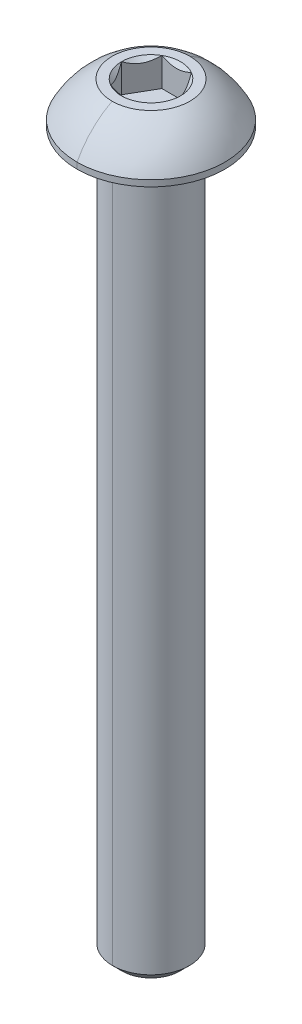
ISO-10303-21;
HEADER;
FILE_DESCRIPTION(('STEP AP214'),'2;1');
FILE_NAME('part.step','',(''),(''),'','','');
FILE_SCHEMA(('AUTOMOTIVE_DESIGN { 1 0 10303 214 1 1 1 1 }'));
ENDSEC;
DATA;
#1=APPLICATION_CONTEXT('core data for automotive mechanical design processes');
#2=APPLICATION_PROTOCOL_DEFINITION('international standard','automotive_design',2000,#1);
#3=PRODUCT_CONTEXT('',#1,'mechanical');
#4=PRODUCT('Part','Part','',(#3));
#5=PRODUCT_RELATED_PRODUCT_CATEGORY('part','',(#4));
#6=PRODUCT_DEFINITION_FORMATION('','',#4);
#7=PRODUCT_DEFINITION_CONTEXT('part definition',#1,'design');
#8=PRODUCT_DEFINITION('design','',#6,#7);
#9=PRODUCT_DEFINITION_SHAPE('','',#8);
#10=(LENGTH_UNIT() NAMED_UNIT(*) SI_UNIT(.MILLI.,.METRE.));
#11=(NAMED_UNIT(*) PLANE_ANGLE_UNIT() SI_UNIT($,.RADIAN.));
#12=(NAMED_UNIT(*) SI_UNIT($,.STERADIAN.) SOLID_ANGLE_UNIT());
#13=UNCERTAINTY_MEASURE_WITH_UNIT(LENGTH_MEASURE(1.E-05),#10,'distance_accuracy_value','');
#14=(GEOMETRIC_REPRESENTATION_CONTEXT(3) GLOBAL_UNCERTAINTY_ASSIGNED_CONTEXT((#13)) GLOBAL_UNIT_ASSIGNED_CONTEXT((#10,
#11,#12)) REPRESENTATION_CONTEXT('',''));
#15=CARTESIAN_POINT('',(0.,0.,0.));
#16=DIRECTION('',(0.,0.,1.));
#17=DIRECTION('',(1.,0.,0.));
#18=AXIS2_PLACEMENT_3D('',#15,#16,#17);
#19=CARTESIAN_POINT('',(0.,-0.152399999999997,0.));
#20=DIRECTION('',(0.,1.,0.));
#21=DIRECTION('',(0.,0.,1.));
#22=AXIS2_PLACEMENT_3D('',#19,#20,#21);
#23=TOROIDAL_SURFACE('',#22,2.5273,0.1524);
#24=CARTESIAN_POINT('',(0.,-0.152399999999997,-2.5273));
#25=DIRECTION('',(1.,0.,0.));
#26=DIRECTION('',(0.,0.,-1.));
#27=AXIS2_PLACEMENT_3D('',#24,#25,#26);
#28=CIRCLE('',#27,0.1524);
#29=CARTESIAN_POINT('',(0.,0.,-2.5273));
#30=VERTEX_POINT('',#29);
#31=CARTESIAN_POINT('',(0.,-0.152399999999997,-2.3749));
#32=VERTEX_POINT('',#31);
#33=EDGE_CURVE('E246',#30,#32,#28,.T.);
#34=ORIENTED_EDGE('',*,*,#33,.F.);
#35=CARTESIAN_POINT('',(0.,0.,0.));
#36=DIRECTION('',(0.,1.,0.));
#37=DIRECTION('',(0.,0.,1.));
#38=AXIS2_PLACEMENT_3D('',#35,#36,#37);
#39=CIRCLE('',#38,2.5273);
#40=CARTESIAN_POINT('',(0.,0.,2.5273));
#41=VERTEX_POINT('',#40);
#42=EDGE_CURVE('E254',#41,#30,#39,.T.);
#43=ORIENTED_EDGE('',*,*,#42,.F.);
#44=CARTESIAN_POINT('',(0.,-0.152399999999997,2.5273));
#45=DIRECTION('',(-1.,0.,0.));
#46=DIRECTION('',(0.,0.,1.));
#47=AXIS2_PLACEMENT_3D('',#44,#45,#46);
#48=CIRCLE('',#47,0.1524);
#49=CARTESIAN_POINT('',(0.,-0.152399999999997,2.3749));
#50=VERTEX_POINT('',#49);
#51=EDGE_CURVE('E253',#41,#50,#48,.T.);
#52=ORIENTED_EDGE('',*,*,#51,.T.);
#53=CARTESIAN_POINT('',(0.,-0.152399999999997,0.));
#54=DIRECTION('',(0.,-1.,0.));
#55=DIRECTION('',(0.,0.,1.));
#56=AXIS2_PLACEMENT_3D('',#53,#54,#55);
#57=CIRCLE('',#56,2.3749);
#58=EDGE_CURVE('E310',#32,#50,#57,.T.);
#59=ORIENTED_EDGE('',*,*,#58,.F.);
#60=EDGE_LOOP('',(#34,#43,#52,#59));
#61=FACE_BOUND('',#60,.T.);
#62=ADVANCED_FACE('F16',(#61),#23,.F.);
#63=CARTESIAN_POINT('',(0.,2.5654,0.));
#64=DIRECTION('',(0.,1.,0.));
#65=DIRECTION('',(0.,0.,1.));
#66=AXIS2_PLACEMENT_3D('',#63,#64,#65);
#67=CONICAL_SURFACE('',#66,1.83308710467706,0.78539816339745);
#68=DIRECTION('',(0.,0.707106781186546,-0.707106781186549));
#69=VECTOR('',#68,1.);
#70=CARTESIAN_POINT('',(0.,2.5654,-1.83308710467706));
#71=LINE('',#70,#69);
#72=CARTESIAN_POINT('',(0.,0.732312895322944,0.));
#73=VERTEX_POINT('',#72);
#74=CARTESIAN_POINT('',(0.,0.7874,-0.0550871046770556));
#75=VERTEX_POINT('',#74);
#76=EDGE_CURVE('E240',#73,#75,#71,.T.);
#77=ORIENTED_EDGE('',*,*,#76,.F.);
#78=DIRECTION('',(0.,0.707106781186546,0.707106781186549));
#79=VECTOR('',#78,1.);
#80=CARTESIAN_POINT('',(0.,2.5654,1.83308710467706));
#81=LINE('',#80,#79);
#82=CARTESIAN_POINT('',(0.,0.7874,0.0550871046770556));
#83=VERTEX_POINT('',#82);
#84=EDGE_CURVE('E245',#73,#83,#81,.T.);
#85=ORIENTED_EDGE('',*,*,#84,.T.);
#86=CARTESIAN_POINT('',(0.,0.7874,0.));
#87=DIRECTION('',(0.,1.,0.));
#88=DIRECTION('',(0.,0.,1.));
#89=AXIS2_PLACEMENT_3D('',#86,#87,#88);
#90=CIRCLE('',#89,0.0550871046770558);
#91=EDGE_CURVE('E214',#83,#75,#90,.T.);
#92=ORIENTED_EDGE('',*,*,#91,.T.);
#93=EDGE_LOOP('',(#77,#85,#92));
#94=FACE_BOUND('',#93,.T.);
#95=ADVANCED_FACE('F334',(#94),#67,.F.);
#96=CARTESIAN_POINT('',(1.83308710467706,0.7874,0.));
#97=DIRECTION('',(0.866025403784439,0.,-0.5));
#98=DIRECTION('',(0.,-1.,0.));
#99=AXIS2_PLACEMENT_3D('',#96,#97,#98);
#100=PLANE('',#99);
#101=DIRECTION('',(0.,1.,0.));
#102=VECTOR('',#101,1.);
#103=CARTESIAN_POINT('',(1.83308710467706,0.7874,0.));
#104=LINE('',#103,#102);
#105=CARTESIAN_POINT('',(1.83308710467706,0.7874,0.));
#106=VERTEX_POINT('',#105);
#107=CARTESIAN_POINT('',(1.83308710467706,2.5654,0.));
#108=VERTEX_POINT('',#107);
#109=EDGE_CURVE('E11',#106,#108,#104,.T.);
#110=ORIENTED_EDGE('',*,*,#109,.T.);
#111=CARTESIAN_POINT('',(1.83308710467706,2.5654,0.));
#112=CARTESIAN_POINT('',(1.58854939316106,2.32086228848399,-0.423551740712339));
#113=CARTESIAN_POINT('',(1.37650342717985,2.31981648546325,-0.790826127331817));
#114=CARTESIAN_POINT('',(1.16317917435944,2.31876437797812,-1.16031457170343));
#115=CARTESIAN_POINT('',(0.91654355233853,2.5654,-1.5875));
#116=B_SPLINE_CURVE_WITH_KNOTS('',2,(#111,#112,#113,#114,#115),.UNSPECIFIED.,.F.,.F.,(3,2,3),
(0.,0.5,1.),.UNSPECIFIED.);
#117=CARTESIAN_POINT('',(0.916543552338531,2.5654,-1.5875));
#118=VERTEX_POINT('',#117);
#119=EDGE_CURVE('E154',#108,#118,#116,.T.);
#120=ORIENTED_EDGE('',*,*,#119,.T.);
#121=DIRECTION('',(0.,1.,0.));
#122=VECTOR('',#121,1.);
#123=CARTESIAN_POINT('',(0.916543552338531,0.7874,-1.5875));
#124=LINE('',#123,#122);
#125=CARTESIAN_POINT('',(0.916543552338531,0.7874,-1.5875));
#126=VERTEX_POINT('',#125);
#127=EDGE_CURVE('E210',#126,#118,#124,.T.);
#128=ORIENTED_EDGE('',*,*,#127,.F.);
#129=DIRECTION('',(-0.5,0.,-0.866025403784439));
#130=VECTOR('',#129,1.);
#131=CARTESIAN_POINT('',(1.83308710467706,0.7874,0.));
#132=LINE('',#131,#130);
#133=EDGE_CURVE('E158',#106,#126,#132,.T.);
#134=ORIENTED_EDGE('',*,*,#133,.F.);
#135=EDGE_LOOP('',(#110,#120,#128,#134));
#136=FACE_BOUND('',#135,.T.);
#137=ADVANCED_FACE('F153',(#136),#100,.F.);
#138=CARTESIAN_POINT('',(0.916543552338531,0.7874,1.5875));
#139=DIRECTION('',(0.866025403784439,0.,0.5));
#140=DIRECTION('',(0.,-1.,0.));
#141=AXIS2_PLACEMENT_3D('',#138,#139,#140);
#142=PLANE('',#141);
#143=DIRECTION('',(0.,1.,0.));
#144=VECTOR('',#143,1.);
#145=CARTESIAN_POINT('',(0.916543552338531,0.7874,1.5875));
#146=LINE('',#145,#144);
#147=CARTESIAN_POINT('',(0.916543552338531,0.7874,1.5875));
#148=VERTEX_POINT('',#147);
#149=CARTESIAN_POINT('',(0.916543552338531,2.5654,1.5875));
#150=VERTEX_POINT('',#149);
#151=EDGE_CURVE('E29',#148,#150,#146,.T.);
#152=ORIENTED_EDGE('',*,*,#151,.T.);
#153=CARTESIAN_POINT('',(0.916543552338531,2.5654,1.5875));
#154=CARTESIAN_POINT('',(1.16108126385472,2.32086228848382,1.16394825928734));
#155=CARTESIAN_POINT('',(1.37312722983574,2.31981648546325,0.796673872668184));
#156=CARTESIAN_POINT('',(1.58645148265633,2.3187643779783,0.427185428296259));
#157=CARTESIAN_POINT('',(1.83308710467706,2.5654,0.));
#158=B_SPLINE_CURVE_WITH_KNOTS('',2,(#153,#154,#155,#156,#157),.UNSPECIFIED.,.F.,.F.,(3,2,3),
(0.,0.5,1.),.UNSPECIFIED.);
#159=EDGE_CURVE('E170',#150,#108,#158,.T.);
#160=ORIENTED_EDGE('',*,*,#159,.T.);
#161=ORIENTED_EDGE('',*,*,#109,.F.);
#162=DIRECTION('',(0.5,0.,-0.866025403784439));
#163=VECTOR('',#162,1.);
#164=CARTESIAN_POINT('',(0.916543552338531,0.7874,1.5875));
#165=LINE('',#164,#163);
#166=EDGE_CURVE('E226',#148,#106,#165,.T.);
#167=ORIENTED_EDGE('',*,*,#166,.F.);
#168=EDGE_LOOP('',(#152,#160,#161,#167));
#169=FACE_BOUND('',#168,.T.);
#170=ADVANCED_FACE('F176',(#169),#142,.F.);
#171=CARTESIAN_POINT('',(-0.91654355233853,0.7874,1.5875));
#172=DIRECTION('',(0.,0.,1.));
#173=DIRECTION('',(1.,0.,0.));
#174=AXIS2_PLACEMENT_3D('',#171,#172,#173);
#175=PLANE('',#174);
#176=DIRECTION('',(0.,1.,0.));
#177=VECTOR('',#176,1.);
#178=CARTESIAN_POINT('',(-0.91654355233853,0.7874,1.5875));
#179=LINE('',#178,#177);
#180=CARTESIAN_POINT('',(-0.91654355233853,0.7874,1.5875));
#181=VERTEX_POINT('',#180);
#182=CARTESIAN_POINT('',(-0.91654355233853,2.5654,1.5875));
#183=VERTEX_POINT('',#182);
#184=EDGE_CURVE('E760',#181,#183,#179,.T.);
#185=ORIENTED_EDGE('',*,*,#184,.T.);
#186=CARTESIAN_POINT('',(-0.916543552338531,2.5654,1.5875));
#187=CARTESIAN_POINT('',(-0.684381010738564,2.44931872920002,1.5875));
#188=CARTESIAN_POINT('',(-0.4718738638875,2.38845938444161,1.5875));
#189=CARTESIAN_POINT('',(-0.232175759974894,2.31981289532294,1.5875));
#190=CARTESIAN_POINT('',(0.,2.31981289532294,1.5875));
#191=B_SPLINE_CURVE_WITH_KNOTS('',2,(#186,#187,#188,#189,#190),.UNSPECIFIED.,.F.,.F.,(3,2,3),
(0.,0.5,1.),.UNSPECIFIED.);
#192=CARTESIAN_POINT('',(0.,2.31981289532294,1.5875));
#193=VERTEX_POINT('',#192);
#194=EDGE_CURVE('E181',#183,#193,#191,.T.);
#195=ORIENTED_EDGE('',*,*,#194,.T.);
#196=CARTESIAN_POINT('',(0.,2.31981289532294,1.5875));
#197=CARTESIAN_POINT('',(0.229732695645398,2.31981289532294,1.5875));
#198=CARTESIAN_POINT('',(0.471961624215038,2.3884843914945,1.5875));
#199=CARTESIAN_POINT('',(0.68154594324368,2.44790119545257,1.5875));
#200=CARTESIAN_POINT('',(0.91654355233853,2.5654,1.5875));
#201=B_SPLINE_CURVE_WITH_KNOTS('',2,(#196,#197,#198,#199,#200),.UNSPECIFIED.,.F.,.F.,(3,2,3),
(0.,0.5,1.),.UNSPECIFIED.);
#202=EDGE_CURVE('E392',#193,#150,#201,.T.);
#203=ORIENTED_EDGE('',*,*,#202,.T.);
#204=ORIENTED_EDGE('',*,*,#151,.F.);
#205=DIRECTION('',(1.,0.,0.));
#206=VECTOR('',#205,1.);
#207=CARTESIAN_POINT('',(-0.91654355233853,0.7874,1.5875));
#208=LINE('',#207,#206);
#209=EDGE_CURVE('E234',#181,#148,#208,.T.);
#210=ORIENTED_EDGE('',*,*,#209,.F.);
#211=EDGE_LOOP('',(#185,#195,#203,#204,#210));
#212=FACE_BOUND('',#211,.T.);
#213=ADVANCED_FACE('F339',(#212),#175,.F.);
#214=CARTESIAN_POINT('',(-1.83308710467706,0.7874,0.));
#215=DIRECTION('',(-0.866025403784439,0.,0.5));
#216=DIRECTION('',(0.,1.,0.));
#217=AXIS2_PLACEMENT_3D('',#214,#215,#216);
#218=PLANE('',#217);
#219=DIRECTION('',(0.,1.,0.));
#220=VECTOR('',#219,1.);
#221=CARTESIAN_POINT('',(-1.83308710467706,0.7874,0.));
#222=LINE('',#221,#220);
#223=CARTESIAN_POINT('',(-1.83308710467706,0.7874,0.));
#224=VERTEX_POINT('',#223);
#225=CARTESIAN_POINT('',(-1.83308710467706,2.5654,0.));
#226=VERTEX_POINT('',#225);
#227=EDGE_CURVE('E224',#224,#226,#222,.T.);
#228=ORIENTED_EDGE('',*,*,#227,.T.);
#229=CARTESIAN_POINT('',(-1.83308710467706,2.5654,0.));
#230=CARTESIAN_POINT('',(-1.58854939316106,2.32086228848399,0.423551740712331));
#231=CARTESIAN_POINT('',(-1.37650342717985,2.31981648546325,0.790826127331817));
#232=CARTESIAN_POINT('',(-1.16317917435944,2.31876437797812,1.16031457170343));
#233=CARTESIAN_POINT('',(-0.91654355233853,2.5654,1.5875));
#234=B_SPLINE_CURVE_WITH_KNOTS('',2,(#229,#230,#231,#232,#233),.UNSPECIFIED.,.F.,.F.,(3,2,3),
(0.,0.5,1.),.UNSPECIFIED.);
#235=EDGE_CURVE('E856',#226,#183,#234,.T.);
#236=ORIENTED_EDGE('',*,*,#235,.T.);
#237=ORIENTED_EDGE('',*,*,#184,.F.);
#238=DIRECTION('',(0.5,0.,0.866025403784438));
#239=VECTOR('',#238,1.);
#240=CARTESIAN_POINT('',(-1.83308710467706,0.7874,0.));
#241=LINE('',#240,#239);
#242=EDGE_CURVE('E259',#224,#181,#241,.T.);
#243=ORIENTED_EDGE('',*,*,#242,.F.);
#244=EDGE_LOOP('',(#228,#236,#237,#243));
#245=FACE_BOUND('',#244,.T.);
#246=ADVANCED_FACE('F370',(#245),#218,.F.);
#247=CARTESIAN_POINT('',(-0.916543552338531,0.7874,-1.5875));
#248=DIRECTION('',(-0.866025403784439,0.,-0.5));
#249=DIRECTION('',(-0.5,0.,0.866025403784439));
#250=AXIS2_PLACEMENT_3D('',#247,#248,#249);
#251=PLANE('',#250);
#252=DIRECTION('',(0.,1.,0.));
#253=VECTOR('',#252,1.);
#254=CARTESIAN_POINT('',(-0.916543552338531,0.7874,-1.5875));
#255=LINE('',#254,#253);
#256=CARTESIAN_POINT('',(-0.916543552338531,0.7874,-1.5875));
#257=VERTEX_POINT('',#256);
#258=CARTESIAN_POINT('',(-0.916543552338531,2.5654,-1.5875));
#259=VERTEX_POINT('',#258);
#260=EDGE_CURVE('E213',#257,#259,#255,.T.);
#261=ORIENTED_EDGE('',*,*,#260,.T.);
#262=CARTESIAN_POINT('',(-0.916543552338531,2.5654,-1.5875));
#263=CARTESIAN_POINT('',(-1.16108126385453,2.320862288484,-1.16394825928767));
#264=CARTESIAN_POINT('',(-1.37312722983574,2.31981648546325,-0.796673872668183));
#265=CARTESIAN_POINT('',(-1.58645148265615,2.31876437797813,-0.427185428296571));
#266=CARTESIAN_POINT('',(-1.83308710467706,2.5654,0.));
#267=B_SPLINE_CURVE_WITH_KNOTS('',2,(#262,#263,#264,#265,#266),.UNSPECIFIED.,.F.,.F.,(3,2,3),
(0.,0.5,1.),.UNSPECIFIED.);
#268=EDGE_CURVE('E861',#259,#226,#267,.T.);
#269=ORIENTED_EDGE('',*,*,#268,.T.);
#270=ORIENTED_EDGE('',*,*,#227,.F.);
#271=DIRECTION('',(-0.5,0.,0.866025403784439));
#272=VECTOR('',#271,1.);
#273=CARTESIAN_POINT('',(-0.916543552338531,0.7874,-1.5875));
#274=LINE('',#273,#272);
#275=EDGE_CURVE('E263',#257,#224,#274,.T.);
#276=ORIENTED_EDGE('',*,*,#275,.F.);
#277=EDGE_LOOP('',(#261,#269,#270,#276));
#278=FACE_BOUND('',#277,.T.);
#279=ADVANCED_FACE('F588',(#278),#251,.F.);
#280=CARTESIAN_POINT('',(0.916543552338531,0.7874,-1.5875));
#281=DIRECTION('',(0.,0.,-1.));
#282=DIRECTION('',(-1.,0.,0.));
#283=AXIS2_PLACEMENT_3D('',#280,#281,#282);
#284=PLANE('',#283);
#285=ORIENTED_EDGE('',*,*,#127,.T.);
#286=CARTESIAN_POINT('',(0.916543552338531,2.5654,-1.5875));
#287=CARTESIAN_POINT('',(0.68330023814449,2.44877834290298,-1.5875));
#288=CARTESIAN_POINT('',(0.472022049766507,2.38850161206546,-1.5875));
#289=CARTESIAN_POINT('',(0.231606862063275,2.31991222444484,-1.5875));
#290=CARTESIAN_POINT('',(0.000126990617285933,2.31981290040219,-1.5875));
#291=CARTESIAN_POINT('',(-0.230319895797069,2.3197140195957,-1.5875));
#292=CARTESIAN_POINT('',(-0.471813597713689,2.38844221424328,-1.5875));
#293=CARTESIAN_POINT('',(-0.682613944360854,2.44843519601116,-1.5875));
#294=CARTESIAN_POINT('',(-0.916543552338529,2.5654,-1.5875));
#295=B_SPLINE_CURVE_WITH_KNOTS('',2,(#286,#287,#288,#289,#290,#291,#292,#293,#294),
.UNSPECIFIED.,.F.,.F.,(3,2,2,2,3),(0.,0.25,0.5,0.75,1.),.UNSPECIFIED.);
#296=EDGE_CURVE('E875',#118,#259,#295,.T.);
#297=ORIENTED_EDGE('',*,*,#296,.T.);
#298=ORIENTED_EDGE('',*,*,#260,.F.);
#299=DIRECTION('',(-1.,0.,0.));
#300=VECTOR('',#299,1.);
#301=CARTESIAN_POINT('',(0.916543552338531,0.7874,-1.5875));
#302=LINE('',#301,#300);
#303=EDGE_CURVE('E281',#126,#257,#302,.T.);
#304=ORIENTED_EDGE('',*,*,#303,.F.);
#305=EDGE_LOOP('',(#285,#297,#298,#304));
#306=FACE_BOUND('',#305,.T.);
#307=ADVANCED_FACE('F593',(#306),#284,.F.);
#308=CARTESIAN_POINT('',(0.,0.7874,0.));
#309=DIRECTION('',(0.,1.,0.));
#310=DIRECTION('',(1.,0.,0.));
#311=AXIS2_PLACEMENT_3D('',#308,#309,#310);
#312=PLANE('',#311);
#313=ORIENTED_EDGE('',*,*,#91,.F.);
#314=CARTESIAN_POINT('',(0.,0.7874,0.));
#315=DIRECTION('',(0.,1.,0.));
#316=DIRECTION('',(0.,0.,1.));
#317=AXIS2_PLACEMENT_3D('',#314,#315,#316);
#318=CIRCLE('',#317,0.0550871046770558);
#319=EDGE_CURVE('E244',#75,#83,#318,.T.);
#320=ORIENTED_EDGE('',*,*,#319,.F.);
#321=EDGE_LOOP('',(#313,#320));
#322=FACE_BOUND('',#321,.T.);
#323=ORIENTED_EDGE('',*,*,#133,.T.);
#324=ORIENTED_EDGE('',*,*,#303,.T.);
#325=ORIENTED_EDGE('',*,*,#275,.T.);
#326=ORIENTED_EDGE('',*,*,#242,.T.);
#327=ORIENTED_EDGE('',*,*,#209,.T.);
#328=ORIENTED_EDGE('',*,*,#166,.T.);
#329=EDGE_LOOP('',(#323,#324,#325,#326,#327,#328));
#330=FACE_BOUND('',#329,.T.);
#331=ADVANCED_FACE('F371',(#322,#330),#312,.T.);
#332=CARTESIAN_POINT('',(0.,2.5654,0.));
#333=DIRECTION('',(0.,1.,0.));
#334=DIRECTION('',(0.,0.,1.));
#335=AXIS2_PLACEMENT_3D('',#332,#333,#334);
#336=CONICAL_SURFACE('',#335,1.83308710467706,0.78539816339745);
#337=CARTESIAN_POINT('',(0.,2.5654,0.));
#338=DIRECTION('',(0.,1.,0.));
#339=DIRECTION('',(0.,0.,1.));
#340=AXIS2_PLACEMENT_3D('',#337,#338,#339);
#341=CIRCLE('',#340,1.83308710467706);
#342=EDGE_CURVE('E167',#108,#118,#341,.T.);
#343=ORIENTED_EDGE('',*,*,#342,.T.);
#344=ORIENTED_EDGE('',*,*,#119,.F.);
#345=EDGE_LOOP('',(#343,#344));
#346=FACE_BOUND('',#345,.T.);
#347=ADVANCED_FACE('F165',(#346),#336,.F.);
#348=CARTESIAN_POINT('',(0.,2.5654,0.));
#349=DIRECTION('',(0.,1.,0.));
#350=DIRECTION('',(0.,0.,1.));
#351=AXIS2_PLACEMENT_3D('',#348,#349,#350);
#352=CONICAL_SURFACE('',#351,1.83308710467706,0.78539816339745);
#353=CARTESIAN_POINT('',(0.,2.5654,0.));
#354=DIRECTION('',(0.,1.,0.));
#355=DIRECTION('',(0.,0.,1.));
#356=AXIS2_PLACEMENT_3D('',#353,#354,#355);
#357=CIRCLE('',#356,1.83308710467706);
#358=EDGE_CURVE('E184',#150,#108,#357,.T.);
#359=ORIENTED_EDGE('',*,*,#358,.T.);
#360=ORIENTED_EDGE('',*,*,#159,.F.);
#361=EDGE_LOOP('',(#359,#360));
#362=FACE_BOUND('',#361,.T.);
#363=ADVANCED_FACE('F185',(#362),#352,.F.);
#364=CARTESIAN_POINT('',(0.,2.5654,0.));
#365=DIRECTION('',(0.,1.,0.));
#366=DIRECTION('',(0.,0.,1.));
#367=AXIS2_PLACEMENT_3D('',#364,#365,#366);
#368=CONICAL_SURFACE('',#367,1.83308710467706,0.78539816339745);
#369=DIRECTION('',(0.,0.707106781186546,0.707106781186549));
#370=VECTOR('',#369,1.);
#371=CARTESIAN_POINT('',(0.,2.5654,1.83308710467706));
#372=LINE('',#371,#370);
#373=CARTESIAN_POINT('',(0.,2.5654,1.83308710467706));
#374=VERTEX_POINT('',#373);
#375=EDGE_CURVE('E395',#193,#374,#372,.T.);
#376=ORIENTED_EDGE('',*,*,#375,.F.);
#377=ORIENTED_EDGE('',*,*,#194,.F.);
#378=CARTESIAN_POINT('',(0.,2.5654,0.));
#379=DIRECTION('',(0.,1.,0.));
#380=DIRECTION('',(0.,0.,1.));
#381=AXIS2_PLACEMENT_3D('',#378,#379,#380);
#382=CIRCLE('',#381,1.83308710467706);
#383=EDGE_CURVE('E190',#183,#374,#382,.T.);
#384=ORIENTED_EDGE('',*,*,#383,.T.);
#385=EDGE_LOOP('',(#376,#377,#384));
#386=FACE_BOUND('',#385,.T.);
#387=ADVANCED_FACE('F364',(#386),#368,.F.);
#388=CARTESIAN_POINT('',(0.,2.5654,0.));
#389=DIRECTION('',(0.,1.,0.));
#390=DIRECTION('',(0.,0.,1.));
#391=AXIS2_PLACEMENT_3D('',#388,#389,#390);
#392=CONICAL_SURFACE('',#391,1.83308710467706,0.78539816339745);
#393=CARTESIAN_POINT('',(0.,2.5654,0.));
#394=DIRECTION('',(0.,1.,0.));
#395=DIRECTION('',(0.,0.,1.));
#396=AXIS2_PLACEMENT_3D('',#393,#394,#395);
#397=CIRCLE('',#396,1.83308710467706);
#398=EDGE_CURVE('E940',#226,#183,#397,.T.);
#399=ORIENTED_EDGE('',*,*,#398,.T.);
#400=ORIENTED_EDGE('',*,*,#235,.F.);
#401=EDGE_LOOP('',(#399,#400));
#402=FACE_BOUND('',#401,.T.);
#403=ADVANCED_FACE('F549',(#402),#392,.F.);
#404=CARTESIAN_POINT('',(0.,2.5654,0.));
#405=DIRECTION('',(0.,1.,0.));
#406=DIRECTION('',(0.,0.,1.));
#407=AXIS2_PLACEMENT_3D('',#404,#405,#406);
#408=CONICAL_SURFACE('',#407,1.83308710467706,0.78539816339745);
#409=CARTESIAN_POINT('',(0.,2.5654,0.));
#410=DIRECTION('',(0.,1.,0.));
#411=DIRECTION('',(0.,0.,1.));
#412=AXIS2_PLACEMENT_3D('',#409,#410,#411);
#413=CIRCLE('',#412,1.83308710467706);
#414=EDGE_CURVE('E925',#259,#226,#413,.T.);
#415=ORIENTED_EDGE('',*,*,#414,.T.);
#416=ORIENTED_EDGE('',*,*,#268,.F.);
#417=EDGE_LOOP('',(#415,#416));
#418=FACE_BOUND('',#417,.T.);
#419=ADVANCED_FACE('F543',(#418),#408,.F.);
#420=CARTESIAN_POINT('',(0.,2.5654,0.));
#421=DIRECTION('',(0.,1.,0.));
#422=DIRECTION('',(0.,0.,1.));
#423=AXIS2_PLACEMENT_3D('',#420,#421,#422);
#424=CONICAL_SURFACE('',#423,1.83308710467706,0.78539816339745);
#425=CARTESIAN_POINT('',(0.,2.5654,0.));
#426=DIRECTION('',(0.,1.,0.));
#427=DIRECTION('',(0.,0.,1.));
#428=AXIS2_PLACEMENT_3D('',#425,#426,#427);
#429=CIRCLE('',#428,1.83308710467706);
#430=EDGE_CURVE('E196',#118,#259,#429,.T.);
#431=ORIENTED_EDGE('',*,*,#430,.T.);
#432=ORIENTED_EDGE('',*,*,#296,.F.);
#433=EDGE_LOOP('',(#431,#432));
#434=FACE_BOUND('',#433,.T.);
#435=ADVANCED_FACE('F548',(#434),#424,.F.);
#436=CARTESIAN_POINT('',(0.,2.5654,-2.413));
#437=DIRECTION('',(0.,-1.,0.));
#438=DIRECTION('',(0.,0.,-1.));
#439=AXIS2_PLACEMENT_3D('',#436,#437,#438);
#440=PLANE('',#439);
#441=ORIENTED_EDGE('',*,*,#430,.F.);
#442=ORIENTED_EDGE('',*,*,#342,.F.);
#443=ORIENTED_EDGE('',*,*,#358,.F.);
#444=CARTESIAN_POINT('',(0.,2.5654,0.));
#445=DIRECTION('',(0.,1.,0.));
#446=DIRECTION('',(0.,0.,1.));
#447=AXIS2_PLACEMENT_3D('',#444,#445,#446);
#448=CIRCLE('',#447,1.83308710467706);
#449=EDGE_CURVE('E314',#374,#150,#448,.T.);
#450=ORIENTED_EDGE('',*,*,#449,.F.);
#451=ORIENTED_EDGE('',*,*,#383,.F.);
#452=ORIENTED_EDGE('',*,*,#398,.F.);
#453=ORIENTED_EDGE('',*,*,#414,.F.);
#454=EDGE_LOOP('',(#441,#442,#443,#450,#451,#452,#453));
#455=FACE_BOUND('',#454,.T.);
#456=CARTESIAN_POINT('',(0.,2.5654,0.));
#457=DIRECTION('',(0.,1.,0.));
#458=DIRECTION('',(0.,0.,1.));
#459=AXIS2_PLACEMENT_3D('',#456,#457,#458);
#460=CIRCLE('',#459,2.413);
#461=CARTESIAN_POINT('',(0.,2.5654,2.413));
#462=VERTEX_POINT('',#461);
#463=CARTESIAN_POINT('',(0.,2.5654,-2.413));
#464=VERTEX_POINT('',#463);
#465=EDGE_CURVE('E274',#462,#464,#460,.T.);
#466=ORIENTED_EDGE('',*,*,#465,.T.);
#467=CARTESIAN_POINT('',(0.,2.5654,0.));
#468=DIRECTION('',(0.,1.,0.));
#469=DIRECTION('',(0.,0.,1.));
#470=AXIS2_PLACEMENT_3D('',#467,#468,#469);
#471=CIRCLE('',#470,2.413);
#472=EDGE_CURVE('E203',#464,#462,#471,.T.);
#473=ORIENTED_EDGE('',*,*,#472,.T.);
#474=EDGE_LOOP('',(#466,#473));
#475=FACE_BOUND('',#474,.T.);
#476=ADVANCED_FACE('F192',(#455,#475),#440,.F.);
#477=CARTESIAN_POINT('',(0.,-1.9398474797777,0.));
#478=DIRECTION('',(0.,1.,0.));
#479=DIRECTION('',(0.,0.,1.));
#480=AXIS2_PLACEMENT_3D('',#477,#478,#479);
#481=DEGENERATE_TOROIDAL_SURFACE('',#480,0.065843178235288,5.08,.T.);
#482=CARTESIAN_POINT('',(0.,-1.9398474797777,-0.065843178235288));
#483=DIRECTION('',(1.,0.,0.));
#484=DIRECTION('',(0.,0.,-1.));
#485=AXIS2_PLACEMENT_3D('',#482,#483,#484);
#486=CIRCLE('',#485,5.08);
#487=CARTESIAN_POINT('',(0.,0.381,-4.5847));
#488=VERTEX_POINT('',#487);
#489=EDGE_CURVE('E270',#488,#464,#486,.T.);
#490=ORIENTED_EDGE('',*,*,#489,.F.);
#491=CARTESIAN_POINT('',(0.,0.381,0.));
#492=DIRECTION('',(0.,1.,0.));
#493=DIRECTION('',(0.,0.,1.));
#494=AXIS2_PLACEMENT_3D('',#491,#492,#493);
#495=CIRCLE('',#494,4.5847);
#496=CARTESIAN_POINT('',(0.,0.381,4.5847));
#497=VERTEX_POINT('',#496);
#498=EDGE_CURVE('E257',#488,#497,#495,.T.);
#499=ORIENTED_EDGE('',*,*,#498,.T.);
#500=CARTESIAN_POINT('',(0.,-1.9398474797777,0.065843178235288));
#501=DIRECTION('',(-1.,0.,0.));
#502=DIRECTION('',(0.,0.,1.));
#503=AXIS2_PLACEMENT_3D('',#500,#501,#502);
#504=CIRCLE('',#503,5.08);
#505=EDGE_CURVE('E276',#497,#462,#504,.T.);
#506=ORIENTED_EDGE('',*,*,#505,.T.);
#507=ORIENTED_EDGE('',*,*,#472,.F.);
#508=EDGE_LOOP('',(#490,#499,#506,#507));
#509=FACE_BOUND('',#508,.T.);
#510=ADVANCED_FACE('F496',(#509),#481,.T.);
#511=CARTESIAN_POINT('',(0.,2.5654,0.));
#512=DIRECTION('',(0.,1.,0.));
#513=DIRECTION('',(0.,0.,1.));
#514=AXIS2_PLACEMENT_3D('',#511,#512,#513);
#515=CYLINDRICAL_SURFACE('',#514,4.5847);
#516=DIRECTION('',(0.,1.,0.));
#517=VECTOR('',#516,1.);
#518=CARTESIAN_POINT('',(0.,2.5654,-4.5847));
#519=LINE('',#518,#517);
#520=CARTESIAN_POINT('',(0.,0.,-4.5847));
#521=VERTEX_POINT('',#520);
#522=EDGE_CURVE('E290',#521,#488,#519,.T.);
#523=ORIENTED_EDGE('',*,*,#522,.F.);
#524=CARTESIAN_POINT('',(0.,0.,0.));
#525=DIRECTION('',(0.,1.,0.));
#526=DIRECTION('',(0.,0.,1.));
#527=AXIS2_PLACEMENT_3D('',#524,#525,#526);
#528=CIRCLE('',#527,4.5847);
#529=CARTESIAN_POINT('',(0.,0.,4.5847));
#530=VERTEX_POINT('',#529);
#531=EDGE_CURVE('E258',#521,#530,#528,.T.);
#532=ORIENTED_EDGE('',*,*,#531,.T.);
#533=DIRECTION('',(0.,1.,0.));
#534=VECTOR('',#533,1.);
#535=CARTESIAN_POINT('',(0.,2.5654,4.5847));
#536=LINE('',#535,#534);
#537=EDGE_CURVE('E293',#530,#497,#536,.T.);
#538=ORIENTED_EDGE('',*,*,#537,.T.);
#539=ORIENTED_EDGE('',*,*,#498,.F.);
#540=EDGE_LOOP('',(#523,#532,#538,#539));
#541=FACE_BOUND('',#540,.T.);
#542=ADVANCED_FACE('F501',(#541),#515,.T.);
#543=CARTESIAN_POINT('',(0.,0.,0.));
#544=DIRECTION('',(0.,1.,0.));
#545=DIRECTION('',(1.,0.,0.));
#546=AXIS2_PLACEMENT_3D('',#543,#544,#545);
#547=PLANE('',#546);
#548=ORIENTED_EDGE('',*,*,#42,.T.);
#549=CARTESIAN_POINT('',(0.,0.,0.));
#550=DIRECTION('',(0.,1.,0.));
#551=DIRECTION('',(0.,0.,1.));
#552=AXIS2_PLACEMENT_3D('',#549,#550,#551);
#553=CIRCLE('',#552,2.5273);
#554=EDGE_CURVE('E250',#30,#41,#553,.T.);
#555=ORIENTED_EDGE('',*,*,#554,.T.);
#556=EDGE_LOOP('',(#548,#555));
#557=FACE_BOUND('',#556,.T.);
#558=CARTESIAN_POINT('',(0.,0.,0.));
#559=DIRECTION('',(0.,1.,0.));
#560=DIRECTION('',(0.,0.,1.));
#561=AXIS2_PLACEMENT_3D('',#558,#559,#560);
#562=CIRCLE('',#561,4.5847);
#563=EDGE_CURVE('E280',#530,#521,#562,.T.);
#564=ORIENTED_EDGE('',*,*,#563,.F.);
#565=ORIENTED_EDGE('',*,*,#531,.F.);
#566=EDGE_LOOP('',(#564,#565));
#567=FACE_BOUND('',#566,.T.);
#568=ADVANCED_FACE('F580',(#557,#567),#547,.F.);
#569=CARTESIAN_POINT('',(0.,-43.8658,0.));
#570=DIRECTION('',(0.,1.,0.));
#571=DIRECTION('',(0.,0.,1.));
#572=AXIS2_PLACEMENT_3D('',#569,#570,#571);
#573=CONICAL_SURFACE('',#572,2.3749,0.785398163397449);
#574=DIRECTION('',(0.,0.707106781186547,-0.707106781186548));
#575=VECTOR('',#574,1.);
#576=CARTESIAN_POINT('',(0.,-43.8658,-2.3749));
#577=LINE('',#576,#575);
#578=CARTESIAN_POINT('',(0.,-44.45,-1.7907));
#579=VERTEX_POINT('',#578);
#580=CARTESIAN_POINT('',(0.,-43.8658,-2.3749));
#581=VERTEX_POINT('',#580);
#582=EDGE_CURVE('E307',#579,#581,#577,.T.);
#583=ORIENTED_EDGE('',*,*,#582,.F.);
#584=CARTESIAN_POINT('',(0.,-44.45,0.));
#585=DIRECTION('',(0.,-1.,0.));
#586=DIRECTION('',(0.,0.,1.));
#587=AXIS2_PLACEMENT_3D('',#584,#585,#586);
#588=CIRCLE('',#587,1.7907);
#589=CARTESIAN_POINT('',(0.,-44.45,1.7907));
#590=VERTEX_POINT('',#589);
#591=EDGE_CURVE('E268',#590,#579,#588,.T.);
#592=ORIENTED_EDGE('',*,*,#591,.F.);
#593=DIRECTION('',(0.,0.707106781186547,0.707106781186548));
#594=VECTOR('',#593,1.);
#595=CARTESIAN_POINT('',(0.,-43.8658,2.3749));
#596=LINE('',#595,#594);
#597=CARTESIAN_POINT('',(0.,-43.8658,2.3749));
#598=VERTEX_POINT('',#597);
#599=EDGE_CURVE('E321',#590,#598,#596,.T.);
#600=ORIENTED_EDGE('',*,*,#599,.T.);
#601=CARTESIAN_POINT('',(0.,-43.8658,0.));
#602=DIRECTION('',(0.,1.,0.));
#603=DIRECTION('',(0.,0.,1.));
#604=AXIS2_PLACEMENT_3D('',#601,#602,#603);
#605=CIRCLE('',#604,2.3749);
#606=EDGE_CURVE('E264',#581,#598,#605,.T.);
#607=ORIENTED_EDGE('',*,*,#606,.F.);
#608=EDGE_LOOP('',(#583,#592,#600,#607));
#609=FACE_BOUND('',#608,.T.);
#610=ADVANCED_FACE('F446',(#609),#573,.T.);
#611=CARTESIAN_POINT('',(0.,-44.45,0.));
#612=DIRECTION('',(0.,1.,0.));
#613=DIRECTION('',(1.,0.,0.));
#614=AXIS2_PLACEMENT_3D('',#611,#612,#613);
#615=PLANE('',#614);
#616=ORIENTED_EDGE('',*,*,#591,.T.);
#617=CARTESIAN_POINT('',(0.,-44.45,0.));
#618=DIRECTION('',(0.,-1.,0.));
#619=DIRECTION('',(0.,0.,1.));
#620=AXIS2_PLACEMENT_3D('',#617,#618,#619);
#621=CIRCLE('',#620,1.7907);
#622=EDGE_CURVE('E298',#579,#590,#621,.T.);
#623=ORIENTED_EDGE('',*,*,#622,.T.);
#624=EDGE_LOOP('',(#616,#623));
#625=FACE_BOUND('',#624,.T.);
#626=ADVANCED_FACE('F686',(#625),#615,.F.);
#627=CARTESIAN_POINT('',(0.,-44.45,0.));
#628=DIRECTION('',(0.,1.,0.));
#629=DIRECTION('',(0.,0.,1.));
#630=AXIS2_PLACEMENT_3D('',#627,#628,#629);
#631=CYLINDRICAL_SURFACE('',#630,2.3749);
#632=DIRECTION('',(0.,1.,0.));
#633=VECTOR('',#632,1.);
#634=CARTESIAN_POINT('',(0.,-44.45,-2.3749));
#635=LINE('',#634,#633);
#636=EDGE_CURVE('E318',#581,#32,#635,.T.);
#637=ORIENTED_EDGE('',*,*,#636,.F.);
#638=ORIENTED_EDGE('',*,*,#606,.T.);
#639=DIRECTION('',(0.,1.,0.));
#640=VECTOR('',#639,1.);
#641=CARTESIAN_POINT('',(0.,-44.45,2.3749));
#642=LINE('',#641,#640);
#643=EDGE_CURVE('E269',#598,#50,#642,.T.);
#644=ORIENTED_EDGE('',*,*,#643,.T.);
#645=CARTESIAN_POINT('',(0.,-0.152399999999997,0.));
#646=DIRECTION('',(0.,-1.,0.));
#647=DIRECTION('',(0.,0.,1.));
#648=AXIS2_PLACEMENT_3D('',#645,#646,#647);
#649=CIRCLE('',#648,2.3749);
#650=EDGE_CURVE('E238',#50,#32,#649,.T.);
#651=ORIENTED_EDGE('',*,*,#650,.T.);
#652=EDGE_LOOP('',(#637,#638,#644,#651));
#653=FACE_BOUND('',#652,.T.);
#654=ADVANCED_FACE('F365',(#653),#631,.T.);
#655=CARTESIAN_POINT('',(0.,-44.45,0.));
#656=DIRECTION('',(0.,1.,0.));
#657=DIRECTION('',(0.,0.,1.));
#658=AXIS2_PLACEMENT_3D('',#655,#656,#657);
#659=CYLINDRICAL_SURFACE('',#658,2.3749);
#660=CARTESIAN_POINT('',(0.,-43.8658,0.));
#661=DIRECTION('',(0.,1.,0.));
#662=DIRECTION('',(0.,0.,1.));
#663=AXIS2_PLACEMENT_3D('',#660,#661,#662);
#664=CIRCLE('',#663,2.3749);
#665=EDGE_CURVE('E419',#598,#581,#664,.T.);
#666=ORIENTED_EDGE('',*,*,#665,.T.);
#667=ORIENTED_EDGE('',*,*,#636,.T.);
#668=ORIENTED_EDGE('',*,*,#58,.T.);
#669=ORIENTED_EDGE('',*,*,#643,.F.);
#670=EDGE_LOOP('',(#666,#667,#668,#669));
#671=FACE_BOUND('',#670,.T.);
#672=ADVANCED_FACE('F340',(#671),#659,.T.);
#673=CARTESIAN_POINT('',(0.,-43.8658,0.));
#674=DIRECTION('',(0.,1.,0.));
#675=DIRECTION('',(0.,0.,1.));
#676=AXIS2_PLACEMENT_3D('',#673,#674,#675);
#677=CONICAL_SURFACE('',#676,2.3749,0.785398163397449);
#678=ORIENTED_EDGE('',*,*,#622,.F.);
#679=ORIENTED_EDGE('',*,*,#582,.T.);
#680=ORIENTED_EDGE('',*,*,#665,.F.);
#681=ORIENTED_EDGE('',*,*,#599,.F.);
#682=EDGE_LOOP('',(#678,#679,#680,#681));
#683=FACE_BOUND('',#682,.T.);
#684=ADVANCED_FACE('F442',(#683),#677,.T.);
#685=CARTESIAN_POINT('',(0.,2.5654,0.));
#686=DIRECTION('',(0.,1.,0.));
#687=DIRECTION('',(0.,0.,1.));
#688=AXIS2_PLACEMENT_3D('',#685,#686,#687);
#689=CYLINDRICAL_SURFACE('',#688,4.5847);
#690=ORIENTED_EDGE('',*,*,#563,.T.);
#691=ORIENTED_EDGE('',*,*,#522,.T.);
#692=CARTESIAN_POINT('',(0.,0.381,0.));
#693=DIRECTION('',(0.,1.,0.));
#694=DIRECTION('',(0.,0.,1.));
#695=AXIS2_PLACEMENT_3D('',#692,#693,#694);
#696=CIRCLE('',#695,4.5847);
#697=EDGE_CURVE('E275',#497,#488,#696,.T.);
#698=ORIENTED_EDGE('',*,*,#697,.F.);
#699=ORIENTED_EDGE('',*,*,#537,.F.);
#700=EDGE_LOOP('',(#690,#691,#698,#699));
#701=FACE_BOUND('',#700,.T.);
#702=ADVANCED_FACE('F570',(#701),#689,.T.);
#703=CARTESIAN_POINT('',(0.,-1.9398474797777,0.));
#704=DIRECTION('',(0.,1.,0.));
#705=DIRECTION('',(0.,0.,1.));
#706=AXIS2_PLACEMENT_3D('',#703,#704,#705);
#707=DEGENERATE_TOROIDAL_SURFACE('',#706,0.065843178235288,5.08,.T.);
#708=ORIENTED_EDGE('',*,*,#697,.T.);
#709=ORIENTED_EDGE('',*,*,#489,.T.);
#710=ORIENTED_EDGE('',*,*,#465,.F.);
#711=ORIENTED_EDGE('',*,*,#505,.F.);
#712=EDGE_LOOP('',(#708,#709,#710,#711));
#713=FACE_BOUND('',#712,.T.);
#714=ADVANCED_FACE('F615',(#713),#707,.T.);
#715=CARTESIAN_POINT('',(0.,2.5654,0.));
#716=DIRECTION('',(0.,1.,0.));
#717=DIRECTION('',(0.,0.,1.));
#718=AXIS2_PLACEMENT_3D('',#715,#716,#717);
#719=CONICAL_SURFACE('',#718,1.83308710467706,0.78539816339745);
#720=ORIENTED_EDGE('',*,*,#202,.F.);
#721=ORIENTED_EDGE('',*,*,#375,.T.);
#722=ORIENTED_EDGE('',*,*,#449,.T.);
#723=EDGE_LOOP('',(#720,#721,#722));
#724=FACE_BOUND('',#723,.T.);
#725=ADVANCED_FACE('F393',(#724),#719,.F.);
#726=CARTESIAN_POINT('',(0.,2.5654,0.));
#727=DIRECTION('',(0.,1.,0.));
#728=DIRECTION('',(0.,0.,1.));
#729=AXIS2_PLACEMENT_3D('',#726,#727,#728);
#730=CONICAL_SURFACE('',#729,1.83308710467706,0.78539816339745);
#731=ORIENTED_EDGE('',*,*,#84,.F.);
#732=ORIENTED_EDGE('',*,*,#76,.T.);
#733=ORIENTED_EDGE('',*,*,#319,.T.);
#734=EDGE_LOOP('',(#731,#732,#733));
#735=FACE_BOUND('',#734,.T.);
#736=ADVANCED_FACE('F479',(#735),#730,.F.);
#737=CARTESIAN_POINT('',(0.,-0.152399999999997,0.));
#738=DIRECTION('',(0.,1.,0.));
#739=DIRECTION('',(0.,0.,1.));
#740=AXIS2_PLACEMENT_3D('',#737,#738,#739);
#741=TOROIDAL_SURFACE('',#740,2.5273,0.1524);
#742=ORIENTED_EDGE('',*,*,#554,.F.);
#743=ORIENTED_EDGE('',*,*,#33,.T.);
#744=ORIENTED_EDGE('',*,*,#650,.F.);
#745=ORIENTED_EDGE('',*,*,#51,.F.);
#746=EDGE_LOOP('',(#742,#743,#744,#745));
#747=FACE_BOUND('',#746,.T.);
#748=ADVANCED_FACE('F18',(#747),#741,.F.);
#749=CLOSED_SHELL('',(#62,#95,#137,#170,#213,#246,#279,#307,#331,#347,#363,#387,#403,#419,#435,
#476,#510,#542,#568,#610,#626,#654,#672,#684,#702,#714,#725,#736,#748));
#750=MANIFOLD_SOLID_BREP('B1',#749);
#751=ADVANCED_BREP_SHAPE_REPRESENTATION('',(#18,#750),#14);
#752=SHAPE_DEFINITION_REPRESENTATION(#9,#751);
ENDSEC;
END-ISO-10303-21;
